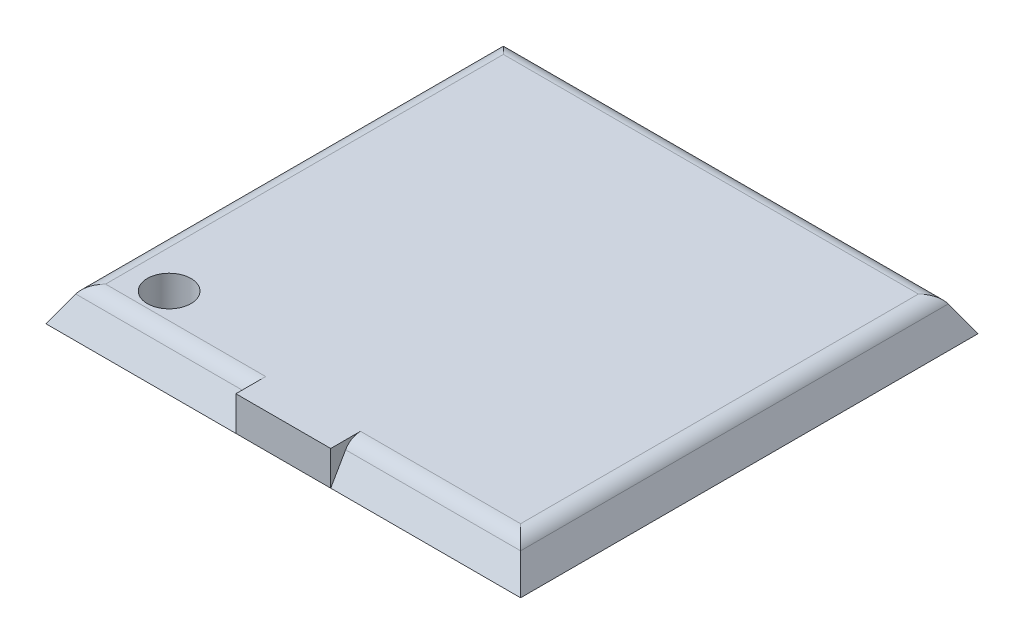
ISO-10303-21;
HEADER;
FILE_DESCRIPTION(('STEP AP214'),'2;1');
FILE_NAME('part.step','',(''),(''),'','','');
FILE_SCHEMA(('AUTOMOTIVE_DESIGN { 1 0 10303 214 1 1 1 1 }'));
ENDSEC;
DATA;
#1=APPLICATION_CONTEXT('core data for automotive mechanical design processes');
#2=APPLICATION_PROTOCOL_DEFINITION('international standard','automotive_design',2000,#1);
#3=PRODUCT_CONTEXT('',#1,'mechanical');
#4=PRODUCT('Part','Part','',(#3));
#5=PRODUCT_RELATED_PRODUCT_CATEGORY('part','',(#4));
#6=PRODUCT_DEFINITION_FORMATION('','',#4);
#7=PRODUCT_DEFINITION_CONTEXT('part definition',#1,'design');
#8=PRODUCT_DEFINITION('design','',#6,#7);
#9=PRODUCT_DEFINITION_SHAPE('','',#8);
#10=(LENGTH_UNIT() NAMED_UNIT(*) SI_UNIT(.MILLI.,.METRE.));
#11=(NAMED_UNIT(*) PLANE_ANGLE_UNIT() SI_UNIT($,.RADIAN.));
#12=(NAMED_UNIT(*) SI_UNIT($,.STERADIAN.) SOLID_ANGLE_UNIT());
#13=UNCERTAINTY_MEASURE_WITH_UNIT(LENGTH_MEASURE(1.E-05),#10,'distance_accuracy_value','');
#14=(GEOMETRIC_REPRESENTATION_CONTEXT(3) GLOBAL_UNCERTAINTY_ASSIGNED_CONTEXT((#13)) GLOBAL_UNIT_ASSIGNED_CONTEXT((#10,
#11,#12)) REPRESENTATION_CONTEXT('',''));
#15=CARTESIAN_POINT('',(0.,0.,0.));
#16=DIRECTION('',(0.,0.,1.));
#17=DIRECTION('',(1.,0.,0.));
#18=AXIS2_PLACEMENT_3D('',#15,#16,#17);
#19=CARTESIAN_POINT('',(-13.8,0.,13.3));
#20=DIRECTION('',(0.,0.500000000000001,0.866025403784438));
#21=DIRECTION('',(0.,-0.866025403784438,0.500000000000001));
#22=AXIS2_PLACEMENT_3D('',#19,#20,#21);
#23=PLANE('',#22);
#24=DIRECTION('',(0.,0.866025403784438,-0.500000000000001));
#25=VECTOR('',#24,1.);
#26=CARTESIAN_POINT('',(-2.75725491651206,0.,13.3));
#27=LINE('',#26,#25);
#28=CARTESIAN_POINT('',(-2.75725491651206,1.5,12.4339745962156));
#29=VERTEX_POINT('',#28);
#30=CARTESIAN_POINT('',(-2.75725491651206,0.,13.3));
#31=VERTEX_POINT('',#30);
#32=EDGE_CURVE('E149',#29,#31,#27,.F.);
#33=ORIENTED_EDGE('',*,*,#32,.F.);
#34=DIRECTION('',(1.,0.,0.));
#35=VECTOR('',#34,1.);
#36=CARTESIAN_POINT('',(-12.6452994616207,1.5,12.4339745962156));
#37=LINE('',#36,#35);
#38=CARTESIAN_POINT('',(-12.9339745962156,1.5,12.4339745962156));
#39=VERTEX_POINT('',#38);
#40=EDGE_CURVE('E62',#29,#39,#37,.F.);
#41=ORIENTED_EDGE('',*,*,#40,.T.);
#42=DIRECTION('',(-0.447213595499958,-0.774596669241482,0.447213595499959));
#43=VECTOR('',#42,1.);
#44=CARTESIAN_POINT('',(-13.8,0.,13.3));
#45=LINE('',#44,#43);
#46=CARTESIAN_POINT('',(-13.8,0.,13.3));
#47=VERTEX_POINT('',#46);
#48=EDGE_CURVE('E195',#39,#47,#45,.T.);
#49=ORIENTED_EDGE('',*,*,#48,.T.);
#50=DIRECTION('',(1.,0.,0.));
#51=VECTOR('',#50,1.);
#52=CARTESIAN_POINT('',(-13.8,0.,13.3));
#53=LINE('',#52,#51);
#54=EDGE_CURVE('E136',#47,#31,#53,.T.);
#55=ORIENTED_EDGE('',*,*,#54,.T.);
#56=EDGE_LOOP('',(#33,#41,#49,#55));
#57=FACE_BOUND('',#56,.T.);
#58=ADVANCED_FACE('F44',(#57),#23,.T.);
#59=DIRECTION('',(0.447213595499959,-0.774596669241482,0.447213595499959));
#60=VECTOR('',#59,1.);
#61=CARTESIAN_POINT('',(8.47999999999999,9.21451029626644,7.97999999999998));
#62=LINE('',#61,#60);
#63=CARTESIAN_POINT('',(12.9339745962156,1.5,12.4339745962156));
#64=VERTEX_POINT('',#63);
#65=CARTESIAN_POINT('',(13.8,0.,13.3));
#66=VERTEX_POINT('',#65);
#67=EDGE_CURVE('E187',#64,#66,#62,.T.);
#68=ORIENTED_EDGE('',*,*,#67,.F.);
#69=DIRECTION('',(1.,0.,0.));
#70=VECTOR('',#69,1.);
#71=CARTESIAN_POINT('',(2.75725491651206,1.5,12.4339745962156));
#72=LINE('',#71,#70);
#73=CARTESIAN_POINT('',(2.75725491651206,1.5,12.4339745962156));
#74=VERTEX_POINT('',#73);
#75=EDGE_CURVE('E143',#64,#74,#72,.F.);
#76=ORIENTED_EDGE('',*,*,#75,.T.);
#77=DIRECTION('',(0.,-0.866025403784438,0.500000000000001));
#78=VECTOR('',#77,1.);
#79=CARTESIAN_POINT('',(2.75725491651206,0.,13.3));
#80=LINE('',#79,#78);
#81=CARTESIAN_POINT('',(2.75725491651206,0.,13.3));
#82=VERTEX_POINT('',#81);
#83=EDGE_CURVE('E140',#82,#74,#80,.F.);
#84=ORIENTED_EDGE('',*,*,#83,.F.);
#85=EDGE_CURVE('E123',#82,#66,#53,.T.);
#86=ORIENTED_EDGE('',*,*,#85,.T.);
#87=EDGE_LOOP('',(#68,#76,#84,#86));
#88=FACE_BOUND('',#87,.T.);
#89=ADVANCED_FACE('F141',(#88),#23,.T.);
#90=CARTESIAN_POINT('',(13.8,0.,-13.3));
#91=DIRECTION('',(0.866025403784438,0.500000000000001,0.));
#92=DIRECTION('',(-0.500000000000001,0.866025403784438,0.));
#93=AXIS2_PLACEMENT_3D('',#90,#91,#92);
#94=PLANE('',#93);
#95=DIRECTION('',(0.447213595499959,-0.774596669241483,-0.447213595499959));
#96=VECTOR('',#95,1.);
#97=CARTESIAN_POINT('',(8.27999999999999,9.56092045778021,-7.77999999999998));
#98=LINE('',#97,#96);
#99=CARTESIAN_POINT('',(12.9339745962156,1.5,-12.4339745962156));
#100=VERTEX_POINT('',#99);
#101=CARTESIAN_POINT('',(13.8,0.,-13.3));
#102=VERTEX_POINT('',#101);
#103=EDGE_CURVE('E188',#100,#102,#98,.T.);
#104=ORIENTED_EDGE('',*,*,#103,.F.);
#105=DIRECTION('',(0.,0.,-1.));
#106=VECTOR('',#105,1.);
#107=CARTESIAN_POINT('',(12.9339745962156,1.5,12.1452994616207));
#108=LINE('',#107,#106);
#109=EDGE_CURVE('E219',#100,#64,#108,.F.);
#110=ORIENTED_EDGE('',*,*,#109,.T.);
#111=ORIENTED_EDGE('',*,*,#67,.T.);
#112=DIRECTION('',(0.,0.,-1.));
#113=VECTOR('',#112,1.);
#114=CARTESIAN_POINT('',(13.8,0.,-13.3));
#115=LINE('',#114,#113);
#116=EDGE_CURVE('E132',#66,#102,#115,.T.);
#117=ORIENTED_EDGE('',*,*,#116,.T.);
#118=EDGE_LOOP('',(#104,#110,#111,#117));
#119=FACE_BOUND('',#118,.T.);
#120=ADVANCED_FACE('F287',(#119),#94,.T.);
#121=CARTESIAN_POINT('',(-13.8,0.,-13.3));
#122=DIRECTION('',(0.,0.500000000000001,-0.866025403784438));
#123=DIRECTION('',(0.,0.866025403784438,0.500000000000001));
#124=AXIS2_PLACEMENT_3D('',#121,#122,#123);
#125=PLANE('',#124);
#126=DIRECTION('',(-0.447213595499959,-0.774596669241483,-0.447213595499959));
#127=VECTOR('',#126,1.);
#128=CARTESIAN_POINT('',(-13.8,0.,-13.3));
#129=LINE('',#128,#127);
#130=CARTESIAN_POINT('',(-12.9339745962156,1.5,-12.4339745962156));
#131=VERTEX_POINT('',#130);
#132=CARTESIAN_POINT('',(-13.8,0.,-13.3));
#133=VERTEX_POINT('',#132);
#134=EDGE_CURVE('E192',#131,#133,#129,.T.);
#135=ORIENTED_EDGE('',*,*,#134,.F.);
#136=DIRECTION('',(-1.,0.,0.));
#137=VECTOR('',#136,1.);
#138=CARTESIAN_POINT('',(12.6452994616207,1.5,-12.4339745962156));
#139=LINE('',#138,#137);
#140=EDGE_CURVE('E216',#131,#100,#139,.F.);
#141=ORIENTED_EDGE('',*,*,#140,.T.);
#142=ORIENTED_EDGE('',*,*,#103,.T.);
#143=DIRECTION('',(-1.,0.,0.));
#144=VECTOR('',#143,1.);
#145=CARTESIAN_POINT('',(-13.8,0.,-13.3));
#146=LINE('',#145,#144);
#147=EDGE_CURVE('E179',#102,#133,#146,.T.);
#148=ORIENTED_EDGE('',*,*,#147,.T.);
#149=EDGE_LOOP('',(#135,#141,#142,#148));
#150=FACE_BOUND('',#149,.T.);
#151=ADVANCED_FACE('F277',(#150),#125,.T.);
#152=CARTESIAN_POINT('',(-13.8,0.,-13.3));
#153=DIRECTION('',(-0.866025403784438,0.500000000000001,0.));
#154=DIRECTION('',(-0.500000000000001,-0.866025403784438,0.));
#155=AXIS2_PLACEMENT_3D('',#152,#153,#154);
#156=PLANE('',#155);
#157=ORIENTED_EDGE('',*,*,#48,.F.);
#158=DIRECTION('',(0.,0.,1.));
#159=VECTOR('',#158,1.);
#160=CARTESIAN_POINT('',(-12.9339745962156,1.5,-12.1452994616207));
#161=LINE('',#160,#159);
#162=EDGE_CURVE('E226',#39,#131,#161,.F.);
#163=ORIENTED_EDGE('',*,*,#162,.T.);
#164=ORIENTED_EDGE('',*,*,#134,.T.);
#165=DIRECTION('',(0.,0.,1.));
#166=VECTOR('',#165,1.);
#167=CARTESIAN_POINT('',(-13.8,0.,-13.3));
#168=LINE('',#167,#166);
#169=EDGE_CURVE('E137',#133,#47,#168,.T.);
#170=ORIENTED_EDGE('',*,*,#169,.T.);
#171=EDGE_LOOP('',(#157,#163,#164,#170));
#172=FACE_BOUND('',#171,.T.);
#173=ADVANCED_FACE('F268',(#172),#156,.T.);
#174=CARTESIAN_POINT('',(0.,2.,0.));
#175=DIRECTION('',(0.,1.,0.));
#176=DIRECTION('',(0.,0.,1.));
#177=AXIS2_PLACEMENT_3D('',#174,#175,#176);
#178=PLANE('',#177);
#179=DIRECTION('',(0.,0.,-1.));
#180=VECTOR('',#179,1.);
#181=CARTESIAN_POINT('',(2.75725491651206,2.,13.3));
#182=LINE('',#181,#180);
#183=CARTESIAN_POINT('',(2.75725491651206,2.,13.3));
#184=VERTEX_POINT('',#183);
#185=CARTESIAN_POINT('',(2.75725491651206,2.,11.5679491924311));
#186=VERTEX_POINT('',#185);
#187=EDGE_CURVE('E150',#184,#186,#182,.T.);
#188=ORIENTED_EDGE('',*,*,#187,.T.);
#189=DIRECTION('',(-1.,0.,0.));
#190=VECTOR('',#189,1.);
#191=CARTESIAN_POINT('',(12.6452994616208,2.,11.5679491924311));
#192=LINE('',#191,#190);
#193=CARTESIAN_POINT('',(12.0679491924311,2.,11.5679491924311));
#194=VERTEX_POINT('',#193);
#195=EDGE_CURVE('E213',#186,#194,#192,.F.);
#196=ORIENTED_EDGE('',*,*,#195,.T.);
#197=DIRECTION('',(0.,0.,1.));
#198=VECTOR('',#197,1.);
#199=CARTESIAN_POINT('',(12.0679491924311,2.,-12.1452994616207));
#200=LINE('',#199,#198);
#201=CARTESIAN_POINT('',(12.0679491924311,2.,-11.5679491924311));
#202=VERTEX_POINT('',#201);
#203=EDGE_CURVE('E210',#194,#202,#200,.F.);
#204=ORIENTED_EDGE('',*,*,#203,.T.);
#205=DIRECTION('',(1.,0.,0.));
#206=VECTOR('',#205,1.);
#207=CARTESIAN_POINT('',(-12.6452994616207,2.,-11.5679491924311));
#208=LINE('',#207,#206);
#209=CARTESIAN_POINT('',(-12.0679491924311,2.,-11.5679491924311));
#210=VERTEX_POINT('',#209);
#211=EDGE_CURVE('E206',#202,#210,#208,.F.);
#212=ORIENTED_EDGE('',*,*,#211,.T.);
#213=DIRECTION('',(0.,0.,-1.));
#214=VECTOR('',#213,1.);
#215=CARTESIAN_POINT('',(-12.0679491924311,2.,12.1452994616207));
#216=LINE('',#215,#214);
#217=CARTESIAN_POINT('',(-12.0679491924311,2.,11.5679491924311));
#218=VERTEX_POINT('',#217);
#219=EDGE_CURVE('E191',#210,#218,#216,.F.);
#220=ORIENTED_EDGE('',*,*,#219,.T.);
#221=DIRECTION('',(-1.,0.,0.));
#222=VECTOR('',#221,1.);
#223=CARTESIAN_POINT('',(-2.75725491651206,2.,11.5679491924311));
#224=LINE('',#223,#222);
#225=CARTESIAN_POINT('',(-2.75725491651206,2.,11.5679491924311));
#226=VERTEX_POINT('',#225);
#227=EDGE_CURVE('E202',#218,#226,#224,.F.);
#228=ORIENTED_EDGE('',*,*,#227,.T.);
#229=DIRECTION('',(0.,0.,-1.));
#230=VECTOR('',#229,1.);
#231=CARTESIAN_POINT('',(-2.75725491651206,2.,13.3));
#232=LINE('',#231,#230);
#233=CARTESIAN_POINT('',(-2.75725491651206,2.,13.3));
#234=VERTEX_POINT('',#233);
#235=EDGE_CURVE('E167',#234,#226,#232,.T.);
#236=ORIENTED_EDGE('',*,*,#235,.F.);
#237=DIRECTION('',(-1.,0.,0.));
#238=VECTOR('',#237,1.);
#239=CARTESIAN_POINT('',(-2.75725491651206,2.,13.3));
#240=LINE('',#239,#238);
#241=EDGE_CURVE('E164',#184,#234,#240,.T.);
#242=ORIENTED_EDGE('',*,*,#241,.F.);
#243=EDGE_LOOP('',(#188,#196,#204,#212,#220,#228,#236,#242));
#244=FACE_BOUND('',#243,.T.);
#245=CARTESIAN_POINT('',(-9.87,2.,10.07));
#246=DIRECTION('',(0.,1.,0.));
#247=DIRECTION('',(0.,0.,1.));
#248=AXIS2_PLACEMENT_3D('',#245,#246,#247);
#249=CIRCLE('',#248,1.27);
#250=CARTESIAN_POINT('',(-9.87,2.,11.34));
#251=VERTEX_POINT('',#250);
#252=EDGE_CURVE('E253',#251,#251,#249,.T.);
#253=ORIENTED_EDGE('',*,*,#252,.F.);
#254=EDGE_LOOP('',(#253));
#255=FACE_BOUND('',#254,.T.);
#256=ADVANCED_FACE('F266',(#244,#255),#178,.T.);
#257=CARTESIAN_POINT('',(0.,0.,0.));
#258=DIRECTION('',(0.,1.,0.));
#259=DIRECTION('',(0.,0.,1.));
#260=AXIS2_PLACEMENT_3D('',#257,#258,#259);
#261=PLANE('',#260);
#262=CARTESIAN_POINT('',(-9.87,0.,10.07));
#263=DIRECTION('',(0.,1.,0.));
#264=DIRECTION('',(0.,0.,1.));
#265=AXIS2_PLACEMENT_3D('',#262,#263,#264);
#266=CIRCLE('',#265,1.27);
#267=CARTESIAN_POINT('',(-9.87,0.,11.34));
#268=VERTEX_POINT('',#267);
#269=EDGE_CURVE('E246',#268,#268,#266,.T.);
#270=ORIENTED_EDGE('',*,*,#269,.T.);
#271=EDGE_LOOP('',(#270));
#272=FACE_BOUND('',#271,.T.);
#273=ORIENTED_EDGE('',*,*,#85,.F.);
#274=DIRECTION('',(1.,0.,0.));
#275=VECTOR('',#274,1.);
#276=CARTESIAN_POINT('',(-2.75725491651206,0.,13.3));
#277=LINE('',#276,#275);
#278=EDGE_CURVE('E128',#31,#82,#277,.T.);
#279=ORIENTED_EDGE('',*,*,#278,.F.);
#280=ORIENTED_EDGE('',*,*,#54,.F.);
#281=ORIENTED_EDGE('',*,*,#169,.F.);
#282=ORIENTED_EDGE('',*,*,#147,.F.);
#283=ORIENTED_EDGE('',*,*,#116,.F.);
#284=EDGE_LOOP('',(#273,#279,#280,#281,#282,#283));
#285=FACE_BOUND('',#284,.T.);
#286=ADVANCED_FACE('F125',(#272,#285),#261,.F.);
#287=CARTESIAN_POINT('',(-2.75725491651206,0.,13.3));
#288=DIRECTION('',(1.,0.,0.));
#289=DIRECTION('',(0.,0.,-1.));
#290=AXIS2_PLACEMENT_3D('',#287,#288,#289);
#291=PLANE('',#290);
#292=ORIENTED_EDGE('',*,*,#235,.T.);
#293=CARTESIAN_POINT('',(-2.75725491651206,1.,11.5679491924311));
#294=DIRECTION('',(1.,0.,0.));
#295=DIRECTION('',(0.,0.,-1.));
#296=AXIS2_PLACEMENT_3D('',#293,#294,#295);
#297=CIRCLE('',#296,1.);
#298=EDGE_CURVE('E11',#226,#29,#297,.T.);
#299=ORIENTED_EDGE('',*,*,#298,.T.);
#300=ORIENTED_EDGE('',*,*,#32,.T.);
#301=DIRECTION('',(0.,-1.,0.));
#302=VECTOR('',#301,1.);
#303=CARTESIAN_POINT('',(-2.75725491651206,0.,13.3));
#304=LINE('',#303,#302);
#305=EDGE_CURVE('E158',#234,#31,#304,.T.);
#306=ORIENTED_EDGE('',*,*,#305,.F.);
#307=EDGE_LOOP('',(#292,#299,#300,#306));
#308=FACE_BOUND('',#307,.T.);
#309=ADVANCED_FACE('F274',(#308),#291,.F.);
#310=CARTESIAN_POINT('',(2.75725491651206,0.,13.3));
#311=DIRECTION('',(-1.,0.,0.));
#312=DIRECTION('',(0.,0.,1.));
#313=AXIS2_PLACEMENT_3D('',#310,#311,#312);
#314=PLANE('',#313);
#315=DIRECTION('',(0.,1.,0.));
#316=VECTOR('',#315,1.);
#317=CARTESIAN_POINT('',(2.75725491651206,0.,13.3));
#318=LINE('',#317,#316);
#319=EDGE_CURVE('E155',#82,#184,#318,.T.);
#320=ORIENTED_EDGE('',*,*,#319,.F.);
#321=ORIENTED_EDGE('',*,*,#83,.T.);
#322=CARTESIAN_POINT('',(2.75725491651206,1.,11.5679491924311));
#323=DIRECTION('',(-1.,0.,0.));
#324=DIRECTION('',(0.,0.,1.));
#325=AXIS2_PLACEMENT_3D('',#322,#323,#324);
#326=CIRCLE('',#325,1.);
#327=EDGE_CURVE('E54',#74,#186,#326,.T.);
#328=ORIENTED_EDGE('',*,*,#327,.T.);
#329=ORIENTED_EDGE('',*,*,#187,.F.);
#330=EDGE_LOOP('',(#320,#321,#328,#329));
#331=FACE_BOUND('',#330,.T.);
#332=ADVANCED_FACE('F161',(#331),#314,.F.);
#333=CARTESIAN_POINT('',(0.,0.,13.3));
#334=DIRECTION('',(0.,0.,-1.));
#335=DIRECTION('',(-1.,0.,0.));
#336=AXIS2_PLACEMENT_3D('',#333,#334,#335);
#337=PLANE('',#336);
#338=ORIENTED_EDGE('',*,*,#305,.T.);
#339=ORIENTED_EDGE('',*,*,#278,.T.);
#340=ORIENTED_EDGE('',*,*,#319,.T.);
#341=ORIENTED_EDGE('',*,*,#241,.T.);
#342=EDGE_LOOP('',(#338,#339,#340,#341));
#343=FACE_BOUND('',#342,.T.);
#344=ADVANCED_FACE('F154',(#343),#337,.F.);
#345=CARTESIAN_POINT('',(-9.87,2.,10.07));
#346=DIRECTION('',(0.,-1.,0.));
#347=DIRECTION('',(0.,0.,-1.));
#348=AXIS2_PLACEMENT_3D('',#345,#346,#347);
#349=CYLINDRICAL_SURFACE('',#348,1.27);
#350=ORIENTED_EDGE('',*,*,#252,.T.);
#351=EDGE_LOOP('',(#350));
#352=FACE_BOUND('',#351,.T.);
#353=ORIENTED_EDGE('',*,*,#269,.F.);
#354=EDGE_LOOP('',(#353));
#355=FACE_BOUND('',#354,.T.);
#356=ADVANCED_FACE('F263',(#352,#355),#349,.F.);
#357=CARTESIAN_POINT('',(0.,1.,11.5679491924311));
#358=DIRECTION('',(1.,0.,0.));
#359=DIRECTION('',(0.,0.,-1.));
#360=AXIS2_PLACEMENT_3D('',#357,#358,#359);
#361=CYLINDRICAL_SURFACE('',#360,1.);
#362=ORIENTED_EDGE('',*,*,#327,.F.);
#363=ORIENTED_EDGE('',*,*,#75,.F.);
#364=CARTESIAN_POINT('',(12.0679491924311,1.,11.5679491924311));
#365=DIRECTION('',(0.707106781186547,0.,-0.707106781186548));
#366=DIRECTION('',(0.707106781186548,0.,0.707106781186547));
#367=AXIS2_PLACEMENT_3D('',#364,#365,#366);
#368=ELLIPSE('',#367,1.4142135623731,1.);
#369=EDGE_CURVE('E48',#194,#64,#368,.T.);
#370=ORIENTED_EDGE('',*,*,#369,.F.);
#371=ORIENTED_EDGE('',*,*,#195,.F.);
#372=EDGE_LOOP('',(#362,#363,#370,#371));
#373=FACE_BOUND('',#372,.T.);
#374=ADVANCED_FACE('F46',(#373),#361,.T.);
#375=CARTESIAN_POINT('',(0.,1.,11.5679491924311));
#376=DIRECTION('',(1.,0.,0.));
#377=DIRECTION('',(0.,0.,-1.));
#378=AXIS2_PLACEMENT_3D('',#375,#376,#377);
#379=CYLINDRICAL_SURFACE('',#378,1.);
#380=ORIENTED_EDGE('',*,*,#298,.F.);
#381=ORIENTED_EDGE('',*,*,#227,.F.);
#382=CARTESIAN_POINT('',(-12.0679491924311,1.,11.5679491924311));
#383=DIRECTION('',(0.707106781186548,0.,0.707106781186547));
#384=DIRECTION('',(-0.707106781186547,0.,0.707106781186548));
#385=AXIS2_PLACEMENT_3D('',#382,#383,#384);
#386=ELLIPSE('',#385,1.41421356237309,1.);
#387=EDGE_CURVE('E237',#39,#218,#386,.F.);
#388=ORIENTED_EDGE('',*,*,#387,.F.);
#389=ORIENTED_EDGE('',*,*,#40,.F.);
#390=EDGE_LOOP('',(#380,#381,#388,#389));
#391=FACE_BOUND('',#390,.T.);
#392=ADVANCED_FACE('F302',(#391),#379,.T.);
#393=CARTESIAN_POINT('',(12.0679491924311,1.,0.));
#394=DIRECTION('',(0.,0.,-1.));
#395=DIRECTION('',(-1.,0.,0.));
#396=AXIS2_PLACEMENT_3D('',#393,#394,#395);
#397=CYLINDRICAL_SURFACE('',#396,1.);
#398=ORIENTED_EDGE('',*,*,#369,.T.);
#399=ORIENTED_EDGE('',*,*,#109,.F.);
#400=CARTESIAN_POINT('',(12.0679491924311,1.,-11.5679491924311));
#401=DIRECTION('',(-0.707106781186548,0.,-0.707106781186547));
#402=DIRECTION('',(0.707106781186547,0.,-0.707106781186548));
#403=AXIS2_PLACEMENT_3D('',#400,#401,#402);
#404=ELLIPSE('',#403,1.41421356237309,1.);
#405=EDGE_CURVE('E234',#202,#100,#404,.T.);
#406=ORIENTED_EDGE('',*,*,#405,.F.);
#407=ORIENTED_EDGE('',*,*,#203,.F.);
#408=EDGE_LOOP('',(#398,#399,#406,#407));
#409=FACE_BOUND('',#408,.T.);
#410=ADVANCED_FACE('F300',(#409),#397,.T.);
#411=CARTESIAN_POINT('',(-12.0679491924311,1.,0.));
#412=DIRECTION('',(0.,0.,1.));
#413=DIRECTION('',(1.,0.,0.));
#414=AXIS2_PLACEMENT_3D('',#411,#412,#413);
#415=CYLINDRICAL_SURFACE('',#414,1.);
#416=ORIENTED_EDGE('',*,*,#387,.T.);
#417=ORIENTED_EDGE('',*,*,#219,.F.);
#418=CARTESIAN_POINT('',(-12.0679491924311,1.,-11.5679491924311));
#419=DIRECTION('',(-0.707106781186547,0.,0.707106781186548));
#420=DIRECTION('',(0.707106781186548,0.,0.707106781186547));
#421=AXIS2_PLACEMENT_3D('',#418,#419,#420);
#422=ELLIPSE('',#421,1.4142135623731,1.);
#423=EDGE_CURVE('E231',#131,#210,#422,.F.);
#424=ORIENTED_EDGE('',*,*,#423,.F.);
#425=ORIENTED_EDGE('',*,*,#162,.F.);
#426=EDGE_LOOP('',(#416,#417,#424,#425));
#427=FACE_BOUND('',#426,.T.);
#428=ADVANCED_FACE('F296',(#427),#415,.T.);
#429=CARTESIAN_POINT('',(0.,1.,-11.5679491924311));
#430=DIRECTION('',(-1.,0.,0.));
#431=DIRECTION('',(0.,0.,1.));
#432=AXIS2_PLACEMENT_3D('',#429,#430,#431);
#433=CYLINDRICAL_SURFACE('',#432,1.);
#434=ORIENTED_EDGE('',*,*,#405,.T.);
#435=ORIENTED_EDGE('',*,*,#140,.F.);
#436=ORIENTED_EDGE('',*,*,#423,.T.);
#437=ORIENTED_EDGE('',*,*,#211,.F.);
#438=EDGE_LOOP('',(#434,#435,#436,#437));
#439=FACE_BOUND('',#438,.T.);
#440=ADVANCED_FACE('F293',(#439),#433,.T.);
#441=CLOSED_SHELL('',(#58,#89,#120,#151,#173,#256,#286,#309,#332,#344,#356,#374,#392,#410,#428,#440));
#442=MANIFOLD_SOLID_BREP('B2',#441);
#443=ADVANCED_BREP_SHAPE_REPRESENTATION('',(#18,#442),#14);
#444=SHAPE_DEFINITION_REPRESENTATION(#9,#443);
ENDSEC;
END-ISO-10303-21;
